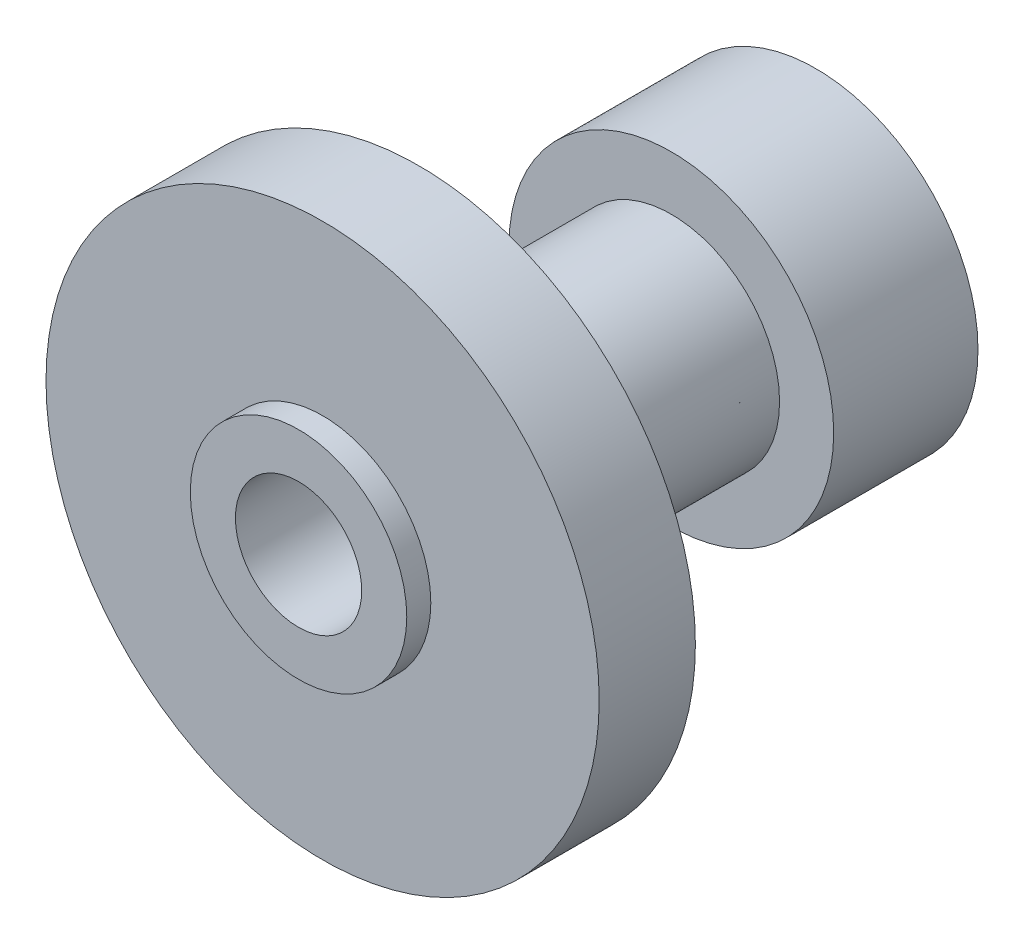
ISO-10303-21;
HEADER;
FILE_DESCRIPTION(('STEP AP214'),'2;1');
FILE_NAME('part.step','',(''),(''),'','','');
FILE_SCHEMA(('AUTOMOTIVE_DESIGN { 1 0 10303 214 1 1 1 1 }'));
ENDSEC;
DATA;
#1=APPLICATION_CONTEXT('core data for automotive mechanical design processes');
#2=APPLICATION_PROTOCOL_DEFINITION('international standard','automotive_design',2000,#1);
#3=PRODUCT_CONTEXT('',#1,'mechanical');
#4=PRODUCT('Part','Part','',(#3));
#5=PRODUCT_RELATED_PRODUCT_CATEGORY('part','',(#4));
#6=PRODUCT_DEFINITION_FORMATION('','',#4);
#7=PRODUCT_DEFINITION_CONTEXT('part definition',#1,'design');
#8=PRODUCT_DEFINITION('design','',#6,#7);
#9=PRODUCT_DEFINITION_SHAPE('','',#8);
#10=(LENGTH_UNIT() NAMED_UNIT(*) SI_UNIT(.MILLI.,.METRE.));
#11=(NAMED_UNIT(*) PLANE_ANGLE_UNIT() SI_UNIT($,.RADIAN.));
#12=(NAMED_UNIT(*) SI_UNIT($,.STERADIAN.) SOLID_ANGLE_UNIT());
#13=UNCERTAINTY_MEASURE_WITH_UNIT(LENGTH_MEASURE(1.E-05),#10,'distance_accuracy_value','');
#14=(GEOMETRIC_REPRESENTATION_CONTEXT(3) GLOBAL_UNCERTAINTY_ASSIGNED_CONTEXT((#13)) GLOBAL_UNIT_ASSIGNED_CONTEXT((#10,
#11,#12)) REPRESENTATION_CONTEXT('',''));
#15=CARTESIAN_POINT('',(0.,0.,0.));
#16=DIRECTION('',(0.,0.,1.));
#17=DIRECTION('',(1.,0.,0.));
#18=AXIS2_PLACEMENT_3D('',#15,#16,#17);
#19=CARTESIAN_POINT('',(0.,0.,8.));
#20=DIRECTION('',(0.,0.,-1.));
#21=DIRECTION('',(-1.,0.,0.));
#22=AXIS2_PLACEMENT_3D('',#19,#20,#21);
#23=CYLINDRICAL_SURFACE('',#22,23.);
#24=CARTESIAN_POINT('',(0.,0.,8.));
#25=DIRECTION('',(0.,0.,1.));
#26=DIRECTION('',(1.,0.,0.));
#27=AXIS2_PLACEMENT_3D('',#24,#25,#26);
#28=CIRCLE('',#27,23.);
#29=CARTESIAN_POINT('',(23.,0.,8.));
#30=VERTEX_POINT('',#29);
#31=EDGE_CURVE('E51',#30,#30,#28,.T.);
#32=ORIENTED_EDGE('',*,*,#31,.F.);
#33=EDGE_LOOP('',(#32));
#34=FACE_BOUND('',#33,.T.);
#35=CARTESIAN_POINT('',(0.,0.,0.));
#36=DIRECTION('',(0.,0.,1.));
#37=DIRECTION('',(1.,0.,0.));
#38=AXIS2_PLACEMENT_3D('',#35,#36,#37);
#39=CIRCLE('',#38,23.);
#40=CARTESIAN_POINT('',(23.,0.,0.));
#41=VERTEX_POINT('',#40);
#42=EDGE_CURVE('E60',#41,#41,#39,.T.);
#43=ORIENTED_EDGE('',*,*,#42,.T.);
#44=EDGE_LOOP('',(#43));
#45=FACE_BOUND('',#44,.T.);
#46=ADVANCED_FACE('F37',(#34,#45),#23,.T.);
#47=CARTESIAN_POINT('',(0.,0.,8.));
#48=DIRECTION('',(0.,0.,1.));
#49=DIRECTION('',(1.,0.,0.));
#50=AXIS2_PLACEMENT_3D('',#47,#48,#49);
#51=PLANE('',#50);
#52=CARTESIAN_POINT('',(0.,0.,8.));
#53=DIRECTION('',(0.,0.,1.));
#54=DIRECTION('',(1.,0.,0.));
#55=AXIS2_PLACEMENT_3D('',#52,#53,#54);
#56=CIRCLE('',#55,9.);
#57=CARTESIAN_POINT('',(9.,0.,8.));
#58=VERTEX_POINT('',#57);
#59=EDGE_CURVE('E45',#58,#58,#56,.T.);
#60=ORIENTED_EDGE('',*,*,#59,.F.);
#61=EDGE_LOOP('',(#60));
#62=FACE_BOUND('',#61,.T.);
#63=ORIENTED_EDGE('',*,*,#31,.T.);
#64=EDGE_LOOP('',(#63));
#65=FACE_BOUND('',#64,.T.);
#66=ADVANCED_FACE('F72',(#62,#65),#51,.T.);
#67=CARTESIAN_POINT('',(0.,0.,0.));
#68=DIRECTION('',(0.,0.,1.));
#69=DIRECTION('',(1.,0.,0.));
#70=AXIS2_PLACEMENT_3D('',#67,#68,#69);
#71=PLANE('',#70);
#72=CARTESIAN_POINT('',(0.,0.,0.));
#73=DIRECTION('',(0.,0.,-1.));
#74=DIRECTION('',(-1.,0.,0.));
#75=AXIS2_PLACEMENT_3D('',#72,#73,#74);
#76=CIRCLE('',#75,9.);
#77=CARTESIAN_POINT('',(-9.,0.,0.));
#78=VERTEX_POINT('',#77);
#79=EDGE_CURVE('E10',#78,#78,#76,.T.);
#80=ORIENTED_EDGE('',*,*,#79,.F.);
#81=EDGE_LOOP('',(#80));
#82=FACE_BOUND('',#81,.T.);
#83=ORIENTED_EDGE('',*,*,#42,.F.);
#84=EDGE_LOOP('',(#83));
#85=FACE_BOUND('',#84,.T.);
#86=ADVANCED_FACE('F69',(#82,#85),#71,.F.);
#87=CARTESIAN_POINT('',(0.,0.,10.));
#88=DIRECTION('',(0.,0.,-1.));
#89=DIRECTION('',(-1.,0.,0.));
#90=AXIS2_PLACEMENT_3D('',#87,#88,#89);
#91=CYLINDRICAL_SURFACE('',#90,9.);
#92=CARTESIAN_POINT('',(0.,0.,10.));
#93=DIRECTION('',(0.,0.,1.));
#94=DIRECTION('',(1.,0.,0.));
#95=AXIS2_PLACEMENT_3D('',#92,#93,#94);
#96=CIRCLE('',#95,9.);
#97=CARTESIAN_POINT('',(9.,0.,10.));
#98=VERTEX_POINT('',#97);
#99=EDGE_CURVE('E57',#98,#98,#96,.T.);
#100=ORIENTED_EDGE('',*,*,#99,.F.);
#101=EDGE_LOOP('',(#100));
#102=FACE_BOUND('',#101,.T.);
#103=ORIENTED_EDGE('',*,*,#59,.T.);
#104=EDGE_LOOP('',(#103));
#105=FACE_BOUND('',#104,.T.);
#106=ADVANCED_FACE('F71',(#102,#105),#91,.T.);
#107=CARTESIAN_POINT('',(0.,0.,10.));
#108=DIRECTION('',(0.,0.,1.));
#109=DIRECTION('',(1.,0.,0.));
#110=AXIS2_PLACEMENT_3D('',#107,#108,#109);
#111=PLANE('',#110);
#112=CARTESIAN_POINT('',(0.,0.,10.));
#113=DIRECTION('',(0.,0.,1.));
#114=DIRECTION('',(1.,0.,0.));
#115=AXIS2_PLACEMENT_3D('',#112,#113,#114);
#116=CIRCLE('',#115,5.25);
#117=CARTESIAN_POINT('',(5.25,0.,10.));
#118=VERTEX_POINT('',#117);
#119=EDGE_CURVE('E40',#118,#118,#116,.T.);
#120=ORIENTED_EDGE('',*,*,#119,.F.);
#121=EDGE_LOOP('',(#120));
#122=FACE_BOUND('',#121,.T.);
#123=ORIENTED_EDGE('',*,*,#99,.T.);
#124=EDGE_LOOP('',(#123));
#125=FACE_BOUND('',#124,.T.);
#126=ADVANCED_FACE('F78',(#122,#125),#111,.T.);
#127=CARTESIAN_POINT('',(0.,0.,-21.));
#128=DIRECTION('',(0.,0.,1.));
#129=DIRECTION('',(1.,0.,0.));
#130=AXIS2_PLACEMENT_3D('',#127,#128,#129);
#131=CYLINDRICAL_SURFACE('',#130,9.);
#132=CARTESIAN_POINT('',(0.,0.,-21.));
#133=DIRECTION('',(0.,0.,-1.));
#134=DIRECTION('',(-1.,0.,0.));
#135=AXIS2_PLACEMENT_3D('',#132,#133,#134);
#136=CIRCLE('',#135,9.);
#137=CARTESIAN_POINT('',(-9.,0.,-21.));
#138=VERTEX_POINT('',#137);
#139=EDGE_CURVE('E55',#138,#138,#136,.T.);
#140=ORIENTED_EDGE('',*,*,#139,.F.);
#141=EDGE_LOOP('',(#140));
#142=FACE_BOUND('',#141,.T.);
#143=ORIENTED_EDGE('',*,*,#79,.T.);
#144=EDGE_LOOP('',(#143));
#145=FACE_BOUND('',#144,.T.);
#146=ADVANCED_FACE('F110',(#142,#145),#131,.T.);
#147=CARTESIAN_POINT('',(0.,0.,-33.));
#148=DIRECTION('',(0.,0.,1.));
#149=DIRECTION('',(1.,0.,0.));
#150=AXIS2_PLACEMENT_3D('',#147,#148,#149);
#151=CYLINDRICAL_SURFACE('',#150,13.5);
#152=CARTESIAN_POINT('',(0.,0.,-33.));
#153=DIRECTION('',(0.,0.,-1.));
#154=DIRECTION('',(-1.,0.,0.));
#155=AXIS2_PLACEMENT_3D('',#152,#153,#154);
#156=CIRCLE('',#155,13.5);
#157=CARTESIAN_POINT('',(-13.5,0.,-33.));
#158=VERTEX_POINT('',#157);
#159=EDGE_CURVE('E205',#158,#158,#156,.T.);
#160=ORIENTED_EDGE('',*,*,#159,.F.);
#161=EDGE_LOOP('',(#160));
#162=FACE_BOUND('',#161,.T.);
#163=CARTESIAN_POINT('',(0.,0.,-21.));
#164=DIRECTION('',(0.,0.,-1.));
#165=DIRECTION('',(-1.,0.,0.));
#166=AXIS2_PLACEMENT_3D('',#163,#164,#165);
#167=CIRCLE('',#166,13.5);
#168=CARTESIAN_POINT('',(-13.5,0.,-21.));
#169=VERTEX_POINT('',#168);
#170=EDGE_CURVE('E201',#169,#169,#167,.T.);
#171=ORIENTED_EDGE('',*,*,#170,.T.);
#172=EDGE_LOOP('',(#171));
#173=FACE_BOUND('',#172,.T.);
#174=ADVANCED_FACE('F115',(#162,#173),#151,.T.);
#175=CARTESIAN_POINT('',(0.,0.,-33.));
#176=DIRECTION('',(0.,0.,-1.));
#177=DIRECTION('',(-1.,0.,0.));
#178=AXIS2_PLACEMENT_3D('',#175,#176,#177);
#179=PLANE('',#178);
#180=CARTESIAN_POINT('',(0.,0.,-33.));
#181=DIRECTION('',(0.,0.,-1.));
#182=DIRECTION('',(-1.,0.,0.));
#183=AXIS2_PLACEMENT_3D('',#180,#181,#182);
#184=CIRCLE('',#183,7.5);
#185=CARTESIAN_POINT('',(-7.5,0.,-33.));
#186=VERTEX_POINT('',#185);
#187=EDGE_CURVE('E195',#186,#186,#184,.T.);
#188=ORIENTED_EDGE('',*,*,#187,.F.);
#189=EDGE_LOOP('',(#188));
#190=FACE_BOUND('',#189,.T.);
#191=ORIENTED_EDGE('',*,*,#159,.T.);
#192=EDGE_LOOP('',(#191));
#193=FACE_BOUND('',#192,.T.);
#194=ADVANCED_FACE('F125',(#190,#193),#179,.T.);
#195=CARTESIAN_POINT('',(0.,0.,-21.));
#196=DIRECTION('',(0.,0.,-1.));
#197=DIRECTION('',(-1.,0.,0.));
#198=AXIS2_PLACEMENT_3D('',#195,#196,#197);
#199=PLANE('',#198);
#200=ORIENTED_EDGE('',*,*,#139,.T.);
#201=EDGE_LOOP('',(#200));
#202=FACE_BOUND('',#201,.T.);
#203=ORIENTED_EDGE('',*,*,#170,.F.);
#204=EDGE_LOOP('',(#203));
#205=FACE_BOUND('',#204,.T.);
#206=ADVANCED_FACE('F133',(#202,#205),#199,.F.);
#207=CARTESIAN_POINT('',(0.,0.,-29.));
#208=DIRECTION('',(0.,0.,-1.));
#209=DIRECTION('',(-1.,0.,0.));
#210=AXIS2_PLACEMENT_3D('',#207,#208,#209);
#211=CYLINDRICAL_SURFACE('',#210,7.5);
#212=CARTESIAN_POINT('',(0.,0.,-29.));
#213=DIRECTION('',(0.,0.,-1.));
#214=DIRECTION('',(-1.,0.,0.));
#215=AXIS2_PLACEMENT_3D('',#212,#213,#214);
#216=CIRCLE('',#215,7.5);
#217=CARTESIAN_POINT('',(-7.5,0.,-29.));
#218=VERTEX_POINT('',#217);
#219=EDGE_CURVE('E197',#218,#218,#216,.T.);
#220=ORIENTED_EDGE('',*,*,#219,.F.);
#221=EDGE_LOOP('',(#220));
#222=FACE_BOUND('',#221,.T.);
#223=ORIENTED_EDGE('',*,*,#187,.T.);
#224=EDGE_LOOP('',(#223));
#225=FACE_BOUND('',#224,.T.);
#226=ADVANCED_FACE('F138',(#222,#225),#211,.F.);
#227=CARTESIAN_POINT('',(0.,0.,-29.));
#228=DIRECTION('',(0.,0.,-1.));
#229=DIRECTION('',(-1.,0.,0.));
#230=AXIS2_PLACEMENT_3D('',#227,#228,#229);
#231=PLANE('',#230);
#232=CARTESIAN_POINT('',(0.,0.,-29.));
#233=DIRECTION('',(0.,0.,-1.));
#234=DIRECTION('',(-1.,0.,0.));
#235=AXIS2_PLACEMENT_3D('',#232,#233,#234);
#236=CIRCLE('',#235,5.25);
#237=CARTESIAN_POINT('',(-5.25,0.,-29.));
#238=VERTEX_POINT('',#237);
#239=EDGE_CURVE('E191',#238,#238,#236,.T.);
#240=ORIENTED_EDGE('',*,*,#239,.F.);
#241=EDGE_LOOP('',(#240));
#242=FACE_BOUND('',#241,.T.);
#243=ORIENTED_EDGE('',*,*,#219,.T.);
#244=EDGE_LOOP('',(#243));
#245=FACE_BOUND('',#244,.T.);
#246=ADVANCED_FACE('F155',(#242,#245),#231,.T.);
#247=CARTESIAN_POINT('',(0.,0.,71.));
#248=DIRECTION('',(0.,0.,-1.));
#249=DIRECTION('',(-1.,0.,0.));
#250=AXIS2_PLACEMENT_3D('',#247,#248,#249);
#251=CYLINDRICAL_SURFACE('',#250,5.25);
#252=ORIENTED_EDGE('',*,*,#119,.T.);
#253=EDGE_LOOP('',(#252));
#254=FACE_BOUND('',#253,.T.);
#255=ORIENTED_EDGE('',*,*,#239,.T.);
#256=EDGE_LOOP('',(#255));
#257=FACE_BOUND('',#256,.T.);
#258=ADVANCED_FACE('F172',(#254,#257),#251,.F.);
#259=CLOSED_SHELL('',(#46,#66,#86,#106,#126,#146,#174,#194,#206,#226,#246,#258));
#260=MANIFOLD_SOLID_BREP('B2',#259);
#261=ADVANCED_BREP_SHAPE_REPRESENTATION('',(#18,#260),#14);
#262=SHAPE_DEFINITION_REPRESENTATION(#9,#261);
ENDSEC;
END-ISO-10303-21;
